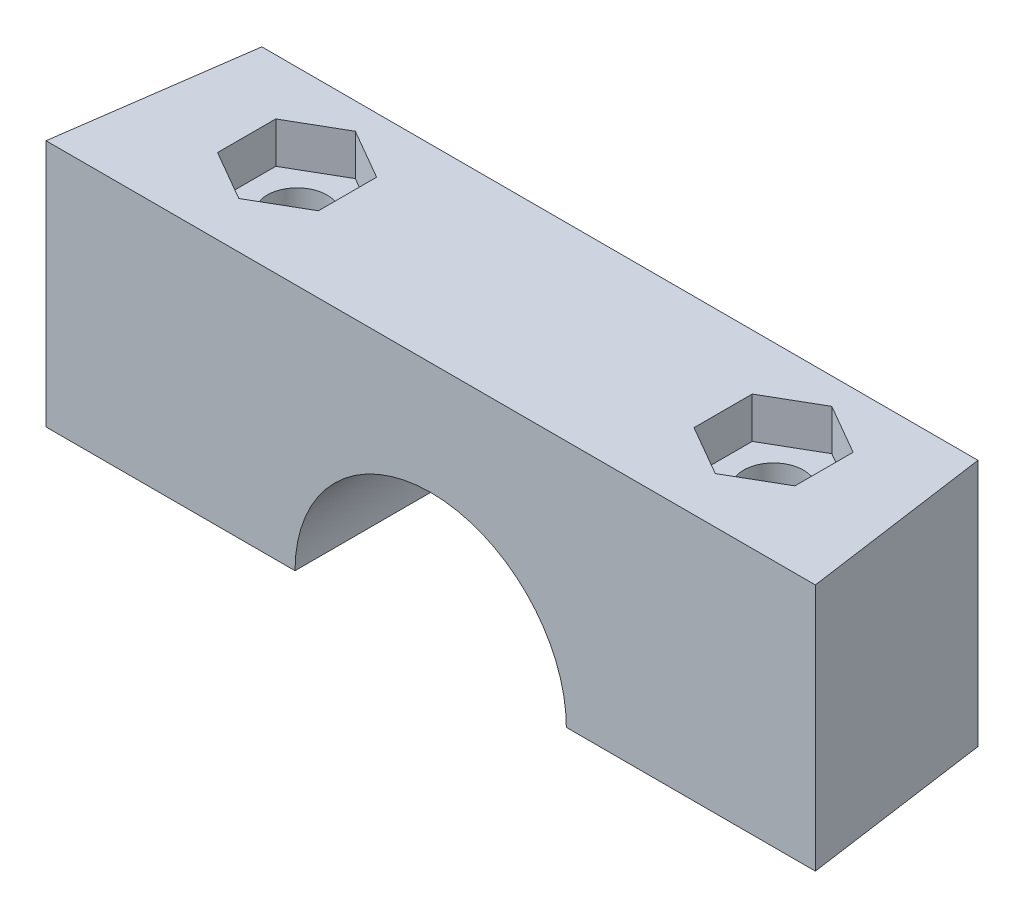
ISO-10303-21;
HEADER;
FILE_DESCRIPTION(('STEP AP214'),'2;1');
FILE_NAME('part.step','',(''),(''),'','','');
FILE_SCHEMA(('AUTOMOTIVE_DESIGN { 1 0 10303 214 1 1 1 1 }'));
ENDSEC;
DATA;
#1=APPLICATION_CONTEXT('core data for automotive mechanical design processes');
#2=APPLICATION_PROTOCOL_DEFINITION('international standard','automotive_design',2000,#1);
#3=PRODUCT_CONTEXT('',#1,'mechanical');
#4=PRODUCT('Part','Part','',(#3));
#5=PRODUCT_RELATED_PRODUCT_CATEGORY('part','',(#4));
#6=PRODUCT_DEFINITION_FORMATION('','',#4);
#7=PRODUCT_DEFINITION_CONTEXT('part definition',#1,'design');
#8=PRODUCT_DEFINITION('design','',#6,#7);
#9=PRODUCT_DEFINITION_SHAPE('','',#8);
#10=(LENGTH_UNIT() NAMED_UNIT(*) SI_UNIT(.MILLI.,.METRE.));
#11=(NAMED_UNIT(*) PLANE_ANGLE_UNIT() SI_UNIT($,.RADIAN.));
#12=(NAMED_UNIT(*) SI_UNIT($,.STERADIAN.) SOLID_ANGLE_UNIT());
#13=UNCERTAINTY_MEASURE_WITH_UNIT(LENGTH_MEASURE(1.E-05),#10,'distance_accuracy_value','');
#14=(GEOMETRIC_REPRESENTATION_CONTEXT(3) GLOBAL_UNCERTAINTY_ASSIGNED_CONTEXT((#13)) GLOBAL_UNIT_ASSIGNED_CONTEXT((#10,
#11,#12)) REPRESENTATION_CONTEXT('',''));
#15=CARTESIAN_POINT('',(0.,0.,0.));
#16=DIRECTION('',(0.,0.,1.));
#17=DIRECTION('',(1.,0.,0.));
#18=AXIS2_PLACEMENT_3D('',#15,#16,#17);
#19=CARTESIAN_POINT('',(12.0979916573324,14.5,41.4619194061058));
#20=DIRECTION('',(0.,1.,0.));
#21=DIRECTION('',(0.,0.,1.));
#22=AXIS2_PLACEMENT_3D('',#19,#20,#21);
#23=CYLINDRICAL_SURFACE('',#22,1.750000056);
#24=CARTESIAN_POINT('',(12.0979916573324,12.1,41.4619194061058));
#25=DIRECTION('',(0.,1.,0.));
#26=DIRECTION('',(0.,0.,1.));
#27=AXIS2_PLACEMENT_3D('',#24,#25,#26);
#28=CIRCLE('',#27,1.750000056);
#29=CARTESIAN_POINT('',(12.0979916573324,12.1,43.2119194621058));
#30=VERTEX_POINT('',#29);
#31=EDGE_CURVE('E351',#30,#30,#28,.T.);
#32=ORIENTED_EDGE('',*,*,#31,.T.);
#33=EDGE_LOOP('',(#32));
#34=FACE_BOUND('',#33,.T.);
#35=CARTESIAN_POINT('',(12.0979916573324,2.4,41.4619194061058));
#36=DIRECTION('',(0.,-1.,0.));
#37=DIRECTION('',(0.,0.,-1.));
#38=AXIS2_PLACEMENT_3D('',#35,#36,#37);
#39=CIRCLE('',#38,1.750000056);
#40=CARTESIAN_POINT('',(12.0979916573324,2.4,39.7119193501059));
#41=VERTEX_POINT('',#40);
#42=EDGE_CURVE('E40',#41,#41,#39,.F.);
#43=ORIENTED_EDGE('',*,*,#42,.F.);
#44=EDGE_LOOP('',(#43));
#45=FACE_BOUND('',#44,.T.);
#46=ADVANCED_FACE('F36',(#34,#45),#23,.F.);
#47=CARTESIAN_POINT('',(-15.7718197692763,14.5,41.4619194061059));
#48=DIRECTION('',(0.,1.,0.));
#49=DIRECTION('',(0.,0.,1.));
#50=AXIS2_PLACEMENT_3D('',#47,#48,#49);
#51=CYLINDRICAL_SURFACE('',#50,1.750000056);
#52=CARTESIAN_POINT('',(-15.7718197692763,12.1,41.4619194061059));
#53=DIRECTION('',(0.,1.,0.));
#54=DIRECTION('',(0.,0.,1.));
#55=AXIS2_PLACEMENT_3D('',#52,#53,#54);
#56=CIRCLE('',#55,1.750000056);
#57=CARTESIAN_POINT('',(-15.7718197692763,12.1,43.2119194621059));
#58=VERTEX_POINT('',#57);
#59=EDGE_CURVE('E348',#58,#58,#56,.T.);
#60=ORIENTED_EDGE('',*,*,#59,.T.);
#61=EDGE_LOOP('',(#60));
#62=FACE_BOUND('',#61,.T.);
#63=CARTESIAN_POINT('',(-15.7718197692763,2.4,41.4619194061059));
#64=DIRECTION('',(0.,-1.,0.));
#65=DIRECTION('',(0.,0.,-1.));
#66=AXIS2_PLACEMENT_3D('',#63,#64,#65);
#67=CIRCLE('',#66,1.750000056);
#68=CARTESIAN_POINT('',(-15.7718197692763,2.4,39.7119193501059));
#69=VERTEX_POINT('',#68);
#70=EDGE_CURVE('E284',#69,#69,#67,.F.);
#71=ORIENTED_EDGE('',*,*,#70,.F.);
#72=EDGE_LOOP('',(#71));
#73=FACE_BOUND('',#72,.T.);
#74=ADVANCED_FACE('F486',(#62,#73),#51,.F.);
#75=CARTESIAN_POINT('',(0.,0.,0.));
#76=DIRECTION('',(0.,-1.,0.));
#77=DIRECTION('',(0.,0.,-1.));
#78=AXIS2_PLACEMENT_3D('',#75,#76,#77);
#79=PLANE('',#78);
#80=DIRECTION('',(0.866025403784439,0.,-0.499999999999999));
#81=VECTOR('',#80,1.);
#82=CARTESIAN_POINT('',(9.14799165733238,0.,39.7587361119964));
#83=LINE('',#82,#81);
#84=CARTESIAN_POINT('',(9.14799165733238,0.,39.7587361119964));
#85=VERTEX_POINT('',#84);
#86=CARTESIAN_POINT('',(12.0979916573324,0.,38.0555528178871));
#87=VERTEX_POINT('',#86);
#88=EDGE_CURVE('E53',#85,#87,#83,.T.);
#89=ORIENTED_EDGE('',*,*,#88,.F.);
#90=DIRECTION('',(0.,0.,-1.));
#91=VECTOR('',#90,1.);
#92=CARTESIAN_POINT('',(9.14799165733238,0.,43.1651027002152));
#93=LINE('',#92,#91);
#94=CARTESIAN_POINT('',(9.14799165733238,0.,43.1651027002152));
#95=VERTEX_POINT('',#94);
#96=EDGE_CURVE('E296',#95,#85,#93,.T.);
#97=ORIENTED_EDGE('',*,*,#96,.F.);
#98=DIRECTION('',(-0.866025403784438,0.,-0.500000000000001));
#99=VECTOR('',#98,1.);
#100=CARTESIAN_POINT('',(12.0979916573324,0.,44.8682859943246));
#101=LINE('',#100,#99);
#102=CARTESIAN_POINT('',(12.0979916573324,0.,44.8682859943246));
#103=VERTEX_POINT('',#102);
#104=EDGE_CURVE('E322',#103,#95,#101,.T.);
#105=ORIENTED_EDGE('',*,*,#104,.F.);
#106=DIRECTION('',(-0.866025403784439,0.,0.5));
#107=VECTOR('',#106,1.);
#108=CARTESIAN_POINT('',(15.0479916573324,0.,43.1651027002152));
#109=LINE('',#108,#107);
#110=CARTESIAN_POINT('',(15.0479916573324,0.,43.1651027002152));
#111=VERTEX_POINT('',#110);
#112=EDGE_CURVE('E319',#111,#103,#109,.T.);
#113=ORIENTED_EDGE('',*,*,#112,.F.);
#114=DIRECTION('',(0.,0.,1.));
#115=VECTOR('',#114,1.);
#116=CARTESIAN_POINT('',(15.0479916573324,0.,39.7587361119965));
#117=LINE('',#116,#115);
#118=CARTESIAN_POINT('',(15.0479916573324,0.,39.7587361119965));
#119=VERTEX_POINT('',#118);
#120=EDGE_CURVE('E316',#119,#111,#117,.T.);
#121=ORIENTED_EDGE('',*,*,#120,.F.);
#122=DIRECTION('',(0.866025403784439,0.,0.499999999999999));
#123=VECTOR('',#122,1.);
#124=CARTESIAN_POINT('',(12.0979916573324,0.,38.0555528178871));
#125=LINE('',#124,#123);
#126=EDGE_CURVE('E313',#87,#119,#125,.T.);
#127=ORIENTED_EDGE('',*,*,#126,.F.);
#128=EDGE_LOOP('',(#89,#97,#105,#113,#121,#127));
#129=FACE_BOUND('',#128,.T.);
#130=DIRECTION('',(-1.,0.,0.));
#131=VECTOR('',#130,1.);
#132=CARTESIAN_POINT('',(0.,0.,36.5131625896884));
#133=LINE('',#132,#131);
#134=CARTESIAN_POINT('',(19.107473621931,0.,36.5131625896884));
#135=VERTEX_POINT('',#134);
#136=CARTESIAN_POINT('',(6.09808594402809,0.,36.5131625896884));
#137=VERTEX_POINT('',#136);
#138=EDGE_CURVE('E346',#135,#137,#133,.T.);
#139=ORIENTED_EDGE('',*,*,#138,.F.);
#140=DIRECTION('',(0.139173100960062,0.,0.990268068741571));
#141=VECTOR('',#140,1.);
#142=CARTESIAN_POINT('',(13.163085944028,0.,-5.78335351177704));
#143=LINE('',#142,#141);
#144=CARTESIAN_POINT('',(20.6630859440281,0.,47.5819194061059));
#145=VERTEX_POINT('',#144);
#146=EDGE_CURVE('E455',#135,#145,#143,.T.);
#147=ORIENTED_EDGE('',*,*,#146,.T.);
#148=DIRECTION('',(-1.,0.,0.));
#149=VECTOR('',#148,1.);
#150=CARTESIAN_POINT('',(20.6630859440281,0.,47.5819194061059));
#151=LINE('',#150,#149);
#152=CARTESIAN_POINT('',(6.09808594402809,0.,47.5819194061059));
#153=VERTEX_POINT('',#152);
#154=EDGE_CURVE('E461',#145,#153,#151,.T.);
#155=ORIENTED_EDGE('',*,*,#154,.T.);
#156=DIRECTION('',(0.,0.,1.));
#157=VECTOR('',#156,1.);
#158=CARTESIAN_POINT('',(6.09808594402809,0.,-40.4180805938941));
#159=LINE('',#158,#157);
#160=EDGE_CURVE('E45',#137,#153,#159,.T.);
#161=ORIENTED_EDGE('',*,*,#160,.F.);
#162=EDGE_LOOP('',(#139,#147,#155,#161));
#163=FACE_BOUND('',#162,.T.);
#164=ADVANCED_FACE('F492',(#129,#163),#79,.T.);
#165=CARTESIAN_POINT('',(20.6630859440281,14.5,47.5819194061059));
#166=DIRECTION('',(0.,0.,1.));
#167=DIRECTION('',(1.,0.,0.));
#168=AXIS2_PLACEMENT_3D('',#165,#166,#167);
#169=PLANE('',#168);
#170=CARTESIAN_POINT('',(-1.83691405597191,0.,47.5819194061059));
#171=DIRECTION('',(0.,0.,1.));
#172=DIRECTION('',(1.,0.,0.));
#173=AXIS2_PLACEMENT_3D('',#170,#171,#172);
#174=CIRCLE('',#173,7.935);
#175=CARTESIAN_POINT('',(-9.7719140559719,0.,47.5819194061059));
#176=VERTEX_POINT('',#175);
#177=EDGE_CURVE('E391',#153,#176,#174,.T.);
#178=ORIENTED_EDGE('',*,*,#177,.F.);
#179=ORIENTED_EDGE('',*,*,#154,.F.);
#180=DIRECTION('',(0.,-1.,0.));
#181=VECTOR('',#180,1.);
#182=CARTESIAN_POINT('',(20.6630859440281,14.5,47.5819194061059));
#183=LINE('',#182,#181);
#184=CARTESIAN_POINT('',(20.6630859440281,14.5,47.5819194061059));
#185=VERTEX_POINT('',#184);
#186=EDGE_CURVE('E468',#185,#145,#183,.T.);
#187=ORIENTED_EDGE('',*,*,#186,.F.);
#188=DIRECTION('',(-1.,0.,0.));
#189=VECTOR('',#188,1.);
#190=CARTESIAN_POINT('',(20.6630859440281,14.5,47.5819194061059));
#191=LINE('',#190,#189);
#192=CARTESIAN_POINT('',(-24.3369140559719,14.5,47.5819194061059));
#193=VERTEX_POINT('',#192);
#194=EDGE_CURVE('E451',#185,#193,#191,.T.);
#195=ORIENTED_EDGE('',*,*,#194,.T.);
#196=DIRECTION('',(0.,-1.,0.));
#197=VECTOR('',#196,1.);
#198=CARTESIAN_POINT('',(-24.3369140559719,14.5,47.5819194061059));
#199=LINE('',#198,#197);
#200=CARTESIAN_POINT('',(-24.3369140559719,0.,47.5819194061059));
#201=VERTEX_POINT('',#200);
#202=EDGE_CURVE('E460',#193,#201,#199,.T.);
#203=ORIENTED_EDGE('',*,*,#202,.T.);
#204=EDGE_CURVE('E450',#176,#201,#151,.T.);
#205=ORIENTED_EDGE('',*,*,#204,.F.);
#206=EDGE_LOOP('',(#178,#179,#187,#195,#203,#205));
#207=FACE_BOUND('',#206,.T.);
#208=ADVANCED_FACE('F38',(#207),#169,.T.);
#209=CARTESIAN_POINT('',(13.163085944028,14.5,-5.78335351177704));
#210=DIRECTION('',(0.990268068741571,0.,-0.139173100960062));
#211=DIRECTION('',(-0.139173100960062,0.,-0.990268068741571));
#212=AXIS2_PLACEMENT_3D('',#209,#210,#211);
#213=PLANE('',#212);
#214=DIRECTION('',(0.,1.,0.));
#215=VECTOR('',#214,1.);
#216=CARTESIAN_POINT('',(19.107473621931,-7.9,36.5131625896884));
#217=LINE('',#216,#215);
#218=CARTESIAN_POINT('',(19.107473621931,14.5,36.5131625896884));
#219=VERTEX_POINT('',#218);
#220=EDGE_CURVE('E340',#135,#219,#217,.T.);
#221=ORIENTED_EDGE('',*,*,#220,.T.);
#222=DIRECTION('',(0.139173100960062,0.,0.990268068741571));
#223=VECTOR('',#222,1.);
#224=CARTESIAN_POINT('',(13.163085944028,14.5,-5.78335351177704));
#225=LINE('',#224,#223);
#226=EDGE_CURVE('E458',#219,#185,#225,.T.);
#227=ORIENTED_EDGE('',*,*,#226,.T.);
#228=ORIENTED_EDGE('',*,*,#186,.T.);
#229=ORIENTED_EDGE('',*,*,#146,.F.);
#230=EDGE_LOOP('',(#221,#227,#228,#229));
#231=FACE_BOUND('',#230,.T.);
#232=ADVANCED_FACE('F567',(#231),#213,.T.);
#233=CARTESIAN_POINT('',(-24.3369140559719,14.5,47.5819194061059));
#234=DIRECTION('',(-0.990268068741571,0.,-0.139173100960062));
#235=DIRECTION('',(-0.139173100960062,0.,0.990268068741571));
#236=AXIS2_PLACEMENT_3D('',#233,#234,#235);
#237=PLANE('',#236);
#238=DIRECTION('',(0.,1.,0.));
#239=VECTOR('',#238,1.);
#240=CARTESIAN_POINT('',(-22.7813017338749,-7.9,36.5131625896884));
#241=LINE('',#240,#239);
#242=CARTESIAN_POINT('',(-22.7813017338749,0.,36.5131625896884));
#243=VERTEX_POINT('',#242);
#244=CARTESIAN_POINT('',(-22.7813017338749,14.5,36.5131625896884));
#245=VERTEX_POINT('',#244);
#246=EDGE_CURVE('E339',#243,#245,#241,.T.);
#247=ORIENTED_EDGE('',*,*,#246,.F.);
#248=DIRECTION('',(0.139173100960062,0.,-0.990268068741571));
#249=VECTOR('',#248,1.);
#250=CARTESIAN_POINT('',(-24.3369140559719,0.,47.5819194061059));
#251=LINE('',#250,#249);
#252=EDGE_CURVE('E464',#201,#243,#251,.T.);
#253=ORIENTED_EDGE('',*,*,#252,.F.);
#254=ORIENTED_EDGE('',*,*,#202,.F.);
#255=DIRECTION('',(0.139173100960062,0.,-0.990268068741571));
#256=VECTOR('',#255,1.);
#257=CARTESIAN_POINT('',(-24.3369140559719,14.5,47.5819194061059));
#258=LINE('',#257,#256);
#259=EDGE_CURVE('E454',#193,#245,#258,.T.);
#260=ORIENTED_EDGE('',*,*,#259,.T.);
#261=EDGE_LOOP('',(#247,#253,#254,#260));
#262=FACE_BOUND('',#261,.T.);
#263=ADVANCED_FACE('F562',(#262),#237,.T.);
#264=CARTESIAN_POINT('',(0.,14.5,0.));
#265=DIRECTION('',(0.,-1.,0.));
#266=DIRECTION('',(0.,0.,-1.));
#267=AXIS2_PLACEMENT_3D('',#264,#265,#266);
#268=PLANE('',#267);
#269=DIRECTION('',(0.866025403784439,0.,-0.5));
#270=VECTOR('',#269,1.);
#271=CARTESIAN_POINT('',(12.0979916573324,14.5,44.8682859943246));
#272=LINE('',#271,#270);
#273=CARTESIAN_POINT('',(12.0979916573324,14.5,44.8682859943246));
#274=VERTEX_POINT('',#273);
#275=CARTESIAN_POINT('',(15.0479916573324,14.5,43.1651027002153));
#276=VERTEX_POINT('',#275);
#277=EDGE_CURVE('E424',#274,#276,#272,.T.);
#278=ORIENTED_EDGE('',*,*,#277,.F.);
#279=DIRECTION('',(0.866025403784439,0.,0.5));
#280=VECTOR('',#279,1.);
#281=CARTESIAN_POINT('',(9.14799165733239,14.5,43.1651027002152));
#282=LINE('',#281,#280);
#283=CARTESIAN_POINT('',(9.14799165733239,14.5,43.1651027002152));
#284=VERTEX_POINT('',#283);
#285=EDGE_CURVE('E422',#284,#274,#282,.T.);
#286=ORIENTED_EDGE('',*,*,#285,.F.);
#287=DIRECTION('',(0.,0.,1.));
#288=VECTOR('',#287,1.);
#289=CARTESIAN_POINT('',(9.14799165733239,14.5,39.7587361119964));
#290=LINE('',#289,#288);
#291=CARTESIAN_POINT('',(9.14799165733239,14.5,39.7587361119964));
#292=VERTEX_POINT('',#291);
#293=EDGE_CURVE('E406',#292,#284,#290,.T.);
#294=ORIENTED_EDGE('',*,*,#293,.F.);
#295=DIRECTION('',(-0.866025403784439,0.,0.5));
#296=VECTOR('',#295,1.);
#297=CARTESIAN_POINT('',(12.0979916573324,14.5,38.0555528178871));
#298=LINE('',#297,#296);
#299=CARTESIAN_POINT('',(12.0979916573324,14.5,38.0555528178871));
#300=VERTEX_POINT('',#299);
#301=EDGE_CURVE('E433',#300,#292,#298,.T.);
#302=ORIENTED_EDGE('',*,*,#301,.F.);
#303=DIRECTION('',(-0.866025403784439,0.,-0.5));
#304=VECTOR('',#303,1.);
#305=CARTESIAN_POINT('',(15.0479916573324,14.5,39.7587361119964));
#306=LINE('',#305,#304);
#307=CARTESIAN_POINT('',(15.0479916573324,14.5,39.7587361119964));
#308=VERTEX_POINT('',#307);
#309=EDGE_CURVE('E430',#308,#300,#306,.T.);
#310=ORIENTED_EDGE('',*,*,#309,.F.);
#311=DIRECTION('',(0.,0.,-1.));
#312=VECTOR('',#311,1.);
#313=CARTESIAN_POINT('',(15.0479916573324,14.5,43.1651027002153));
#314=LINE('',#313,#312);
#315=EDGE_CURVE('E427',#276,#308,#314,.T.);
#316=ORIENTED_EDGE('',*,*,#315,.F.);
#317=EDGE_LOOP('',(#278,#286,#294,#302,#310,#316));
#318=FACE_BOUND('',#317,.T.);
#319=DIRECTION('',(0.866025403784439,0.,-0.5));
#320=VECTOR('',#319,1.);
#321=CARTESIAN_POINT('',(-15.7718197692763,14.5,44.8682859943246));
#322=LINE('',#321,#320);
#323=CARTESIAN_POINT('',(-15.7718197692763,14.5,44.8682859943246));
#324=VERTEX_POINT('',#323);
#325=CARTESIAN_POINT('',(-12.8218197692763,14.5,43.1651027002152));
#326=VERTEX_POINT('',#325);
#327=EDGE_CURVE('E374',#324,#326,#322,.T.);
#328=ORIENTED_EDGE('',*,*,#327,.F.);
#329=DIRECTION('',(0.866025403784439,0.,0.5));
#330=VECTOR('',#329,1.);
#331=CARTESIAN_POINT('',(-18.7218197692763,14.5,43.1651027002153));
#332=LINE('',#331,#330);
#333=CARTESIAN_POINT('',(-18.7218197692763,14.5,43.1651027002153));
#334=VERTEX_POINT('',#333);
#335=EDGE_CURVE('E372',#334,#324,#332,.T.);
#336=ORIENTED_EDGE('',*,*,#335,.F.);
#337=DIRECTION('',(0.,0.,1.));
#338=VECTOR('',#337,1.);
#339=CARTESIAN_POINT('',(-18.7218197692763,14.5,39.7587361119965));
#340=LINE('',#339,#338);
#341=CARTESIAN_POINT('',(-18.7218197692763,14.5,39.7587361119965));
#342=VERTEX_POINT('',#341);
#343=EDGE_CURVE('E356',#342,#334,#340,.T.);
#344=ORIENTED_EDGE('',*,*,#343,.F.);
#345=DIRECTION('',(-0.866025403784439,0.,0.5));
#346=VECTOR('',#345,1.);
#347=CARTESIAN_POINT('',(-15.7718197692763,14.5,38.0555528178871));
#348=LINE('',#347,#346);
#349=CARTESIAN_POINT('',(-15.7718197692763,14.5,38.0555528178871));
#350=VERTEX_POINT('',#349);
#351=EDGE_CURVE('E384',#350,#342,#348,.T.);
#352=ORIENTED_EDGE('',*,*,#351,.F.);
#353=DIRECTION('',(-0.866025403784439,0.,-0.5));
#354=VECTOR('',#353,1.);
#355=CARTESIAN_POINT('',(-12.8218197692763,14.5,39.7587361119965));
#356=LINE('',#355,#354);
#357=CARTESIAN_POINT('',(-12.8218197692763,14.5,39.7587361119965));
#358=VERTEX_POINT('',#357);
#359=EDGE_CURVE('E381',#358,#350,#356,.T.);
#360=ORIENTED_EDGE('',*,*,#359,.F.);
#361=DIRECTION('',(0.,0.,-1.));
#362=VECTOR('',#361,1.);
#363=CARTESIAN_POINT('',(-12.8218197692763,14.5,43.1651027002152));
#364=LINE('',#363,#362);
#365=EDGE_CURVE('E378',#326,#358,#364,.T.);
#366=ORIENTED_EDGE('',*,*,#365,.F.);
#367=EDGE_LOOP('',(#328,#336,#344,#352,#360,#366));
#368=FACE_BOUND('',#367,.T.);
#369=ORIENTED_EDGE('',*,*,#226,.F.);
#370=DIRECTION('',(1.,0.,0.));
#371=VECTOR('',#370,1.);
#372=CARTESIAN_POINT('',(-22.7813017338749,14.5,36.5131625896884));
#373=LINE('',#372,#371);
#374=EDGE_CURVE('E337',#245,#219,#373,.T.);
#375=ORIENTED_EDGE('',*,*,#374,.F.);
#376=ORIENTED_EDGE('',*,*,#259,.F.);
#377=ORIENTED_EDGE('',*,*,#194,.F.);
#378=EDGE_LOOP('',(#369,#375,#376,#377));
#379=FACE_BOUND('',#378,.T.);
#380=ADVANCED_FACE('F559',(#318,#368,#379),#268,.F.);
#381=DIRECTION('',(0.866025403784439,0.,-0.5));
#382=VECTOR('',#381,1.);
#383=CARTESIAN_POINT('',(-18.7218197692763,0.,39.7587361119965));
#384=LINE('',#383,#382);
#385=CARTESIAN_POINT('',(-18.7218197692763,0.,39.7587361119965));
#386=VERTEX_POINT('',#385);
#387=CARTESIAN_POINT('',(-15.7718197692763,0.,38.0555528178871));
#388=VERTEX_POINT('',#387);
#389=EDGE_CURVE('E61',#386,#388,#384,.T.);
#390=ORIENTED_EDGE('',*,*,#389,.F.);
#391=DIRECTION('',(0.,0.,-1.));
#392=VECTOR('',#391,1.);
#393=CARTESIAN_POINT('',(-18.7218197692763,0.,43.1651027002153));
#394=LINE('',#393,#392);
#395=CARTESIAN_POINT('',(-18.7218197692763,0.,43.1651027002153));
#396=VERTEX_POINT('',#395);
#397=EDGE_CURVE('E257',#396,#386,#394,.T.);
#398=ORIENTED_EDGE('',*,*,#397,.F.);
#399=DIRECTION('',(-0.866025403784438,0.,-0.500000000000001));
#400=VECTOR('',#399,1.);
#401=CARTESIAN_POINT('',(-15.7718197692763,0.,44.8682859943247));
#402=LINE('',#401,#400);
#403=CARTESIAN_POINT('',(-15.7718197692763,0.,44.8682859943247));
#404=VERTEX_POINT('',#403);
#405=EDGE_CURVE('E260',#404,#396,#402,.T.);
#406=ORIENTED_EDGE('',*,*,#405,.F.);
#407=DIRECTION('',(-0.866025403784439,0.,0.5));
#408=VECTOR('',#407,1.);
#409=CARTESIAN_POINT('',(-12.8218197692763,0.,43.1651027002153));
#410=LINE('',#409,#408);
#411=CARTESIAN_POINT('',(-12.8218197692763,0.,43.1651027002153));
#412=VERTEX_POINT('',#411);
#413=EDGE_CURVE('E277',#412,#404,#410,.T.);
#414=ORIENTED_EDGE('',*,*,#413,.F.);
#415=DIRECTION('',(0.,0.,1.));
#416=VECTOR('',#415,1.);
#417=CARTESIAN_POINT('',(-12.8218197692763,0.,39.7587361119965));
#418=LINE('',#417,#416);
#419=CARTESIAN_POINT('',(-12.8218197692763,0.,39.7587361119965));
#420=VERTEX_POINT('',#419);
#421=EDGE_CURVE('E274',#420,#412,#418,.T.);
#422=ORIENTED_EDGE('',*,*,#421,.F.);
#423=DIRECTION('',(0.866025403784439,0.,0.499999999999999));
#424=VECTOR('',#423,1.);
#425=CARTESIAN_POINT('',(-15.7718197692763,0.,38.0555528178871));
#426=LINE('',#425,#424);
#427=EDGE_CURVE('E271',#388,#420,#426,.T.);
#428=ORIENTED_EDGE('',*,*,#427,.F.);
#429=EDGE_LOOP('',(#390,#398,#406,#414,#422,#428));
#430=FACE_BOUND('',#429,.T.);
#431=DIRECTION('',(-1.,0.,0.));
#432=VECTOR('',#431,1.);
#433=CARTESIAN_POINT('',(0.,0.,36.5131625896884));
#434=LINE('',#433,#432);
#435=CARTESIAN_POINT('',(-9.77191405597191,0.,36.5131625896884));
#436=VERTEX_POINT('',#435);
#437=EDGE_CURVE('E343',#436,#243,#434,.T.);
#438=ORIENTED_EDGE('',*,*,#437,.F.);
#439=DIRECTION('',(0.,0.,1.));
#440=VECTOR('',#439,1.);
#441=CARTESIAN_POINT('',(-9.77191405597191,0.,-40.4180805938941));
#442=LINE('',#441,#440);
#443=EDGE_CURVE('E471',#176,#436,#442,.F.);
#444=ORIENTED_EDGE('',*,*,#443,.F.);
#445=ORIENTED_EDGE('',*,*,#204,.T.);
#446=ORIENTED_EDGE('',*,*,#252,.T.);
#447=EDGE_LOOP('',(#438,#444,#445,#446));
#448=FACE_BOUND('',#447,.T.);
#449=ADVANCED_FACE('F557',(#430,#448),#79,.T.);
#450=CARTESIAN_POINT('',(-1.83691405597191,0.,-40.4180805938941));
#451=DIRECTION('',(0.,0.,1.));
#452=DIRECTION('',(1.,0.,0.));
#453=AXIS2_PLACEMENT_3D('',#450,#451,#452);
#454=CYLINDRICAL_SURFACE('',#453,7.935);
#455=ORIENTED_EDGE('',*,*,#443,.T.);
#456=CARTESIAN_POINT('',(-1.83691405597191,0.,36.5131625896884));
#457=DIRECTION('',(0.,0.,1.));
#458=DIRECTION('',(1.,0.,0.));
#459=AXIS2_PLACEMENT_3D('',#456,#457,#458);
#460=CIRCLE('',#459,7.935);
#461=EDGE_CURVE('E11',#436,#137,#460,.F.);
#462=ORIENTED_EDGE('',*,*,#461,.T.);
#463=ORIENTED_EDGE('',*,*,#160,.T.);
#464=ORIENTED_EDGE('',*,*,#177,.T.);
#465=EDGE_LOOP('',(#455,#462,#463,#464));
#466=FACE_BOUND('',#465,.T.);
#467=ADVANCED_FACE('F525',(#466),#454,.F.);
#468=CARTESIAN_POINT('',(-18.7218197692763,12.1,43.1651027002153));
#469=DIRECTION('',(-0.5,0.,0.866025403784439));
#470=DIRECTION('',(0.866025403784439,0.,0.5));
#471=AXIS2_PLACEMENT_3D('',#468,#469,#470);
#472=PLANE('',#471);
#473=ORIENTED_EDGE('',*,*,#335,.T.);
#474=DIRECTION('',(0.,1.,0.));
#475=VECTOR('',#474,1.);
#476=CARTESIAN_POINT('',(-15.7718197692763,12.1,44.8682859943246));
#477=LINE('',#476,#475);
#478=CARTESIAN_POINT('',(-15.7718197692763,12.1,44.8682859943246));
#479=VERTEX_POINT('',#478);
#480=EDGE_CURVE('E371',#479,#324,#477,.T.);
#481=ORIENTED_EDGE('',*,*,#480,.F.);
#482=DIRECTION('',(0.866025403784439,0.,0.5));
#483=VECTOR('',#482,1.);
#484=CARTESIAN_POINT('',(-18.7218197692763,12.1,43.1651027002153));
#485=LINE('',#484,#483);
#486=CARTESIAN_POINT('',(-18.7218197692763,12.1,43.1651027002153));
#487=VERTEX_POINT('',#486);
#488=EDGE_CURVE('E352',#487,#479,#485,.T.);
#489=ORIENTED_EDGE('',*,*,#488,.F.);
#490=DIRECTION('',(0.,1.,0.));
#491=VECTOR('',#490,1.);
#492=CARTESIAN_POINT('',(-18.7218197692763,12.1,43.1651027002153));
#493=LINE('',#492,#491);
#494=EDGE_CURVE('E389',#487,#334,#493,.T.);
#495=ORIENTED_EDGE('',*,*,#494,.T.);
#496=EDGE_LOOP('',(#473,#481,#489,#495));
#497=FACE_BOUND('',#496,.T.);
#498=ADVANCED_FACE('F507',(#497),#472,.F.);
#499=CARTESIAN_POINT('',(-18.7218197692763,12.1,39.7587361119965));
#500=DIRECTION('',(-1.,0.,0.));
#501=DIRECTION('',(0.,0.,1.));
#502=AXIS2_PLACEMENT_3D('',#499,#500,#501);
#503=PLANE('',#502);
#504=ORIENTED_EDGE('',*,*,#343,.T.);
#505=ORIENTED_EDGE('',*,*,#494,.F.);
#506=DIRECTION('',(0.,0.,1.));
#507=VECTOR('',#506,1.);
#508=CARTESIAN_POINT('',(-18.7218197692763,12.1,39.7587361119965));
#509=LINE('',#508,#507);
#510=CARTESIAN_POINT('',(-18.7218197692763,12.1,39.7587361119965));
#511=VERTEX_POINT('',#510);
#512=EDGE_CURVE('E368',#511,#487,#509,.T.);
#513=ORIENTED_EDGE('',*,*,#512,.F.);
#514=DIRECTION('',(0.,1.,0.));
#515=VECTOR('',#514,1.);
#516=CARTESIAN_POINT('',(-18.7218197692763,12.1,39.7587361119965));
#517=LINE('',#516,#515);
#518=EDGE_CURVE('E392',#511,#342,#517,.T.);
#519=ORIENTED_EDGE('',*,*,#518,.T.);
#520=EDGE_LOOP('',(#504,#505,#513,#519));
#521=FACE_BOUND('',#520,.T.);
#522=ADVANCED_FACE('F503',(#521),#503,.F.);
#523=CARTESIAN_POINT('',(-15.7718197692763,12.1,38.0555528178871));
#524=DIRECTION('',(-0.5,0.,-0.866025403784439));
#525=DIRECTION('',(-0.866025403784439,0.,0.5));
#526=AXIS2_PLACEMENT_3D('',#523,#524,#525);
#527=PLANE('',#526);
#528=ORIENTED_EDGE('',*,*,#351,.T.);
#529=ORIENTED_EDGE('',*,*,#518,.F.);
#530=DIRECTION('',(-0.866025403784439,0.,0.5));
#531=VECTOR('',#530,1.);
#532=CARTESIAN_POINT('',(-15.7718197692763,12.1,38.0555528178871));
#533=LINE('',#532,#531);
#534=CARTESIAN_POINT('',(-15.7718197692763,12.1,38.0555528178871));
#535=VERTEX_POINT('',#534);
#536=EDGE_CURVE('E365',#535,#511,#533,.T.);
#537=ORIENTED_EDGE('',*,*,#536,.F.);
#538=DIRECTION('',(0.,1.,0.));
#539=VECTOR('',#538,1.);
#540=CARTESIAN_POINT('',(-15.7718197692763,12.1,38.0555528178871));
#541=LINE('',#540,#539);
#542=EDGE_CURVE('E394',#535,#350,#541,.T.);
#543=ORIENTED_EDGE('',*,*,#542,.T.);
#544=EDGE_LOOP('',(#528,#529,#537,#543));
#545=FACE_BOUND('',#544,.T.);
#546=ADVANCED_FACE('F506',(#545),#527,.F.);
#547=CARTESIAN_POINT('',(-12.8218197692763,12.1,39.7587361119965));
#548=DIRECTION('',(0.5,0.,-0.866025403784439));
#549=DIRECTION('',(-0.866025403784439,0.,-0.5));
#550=AXIS2_PLACEMENT_3D('',#547,#548,#549);
#551=PLANE('',#550);
#552=ORIENTED_EDGE('',*,*,#359,.T.);
#553=ORIENTED_EDGE('',*,*,#542,.F.);
#554=DIRECTION('',(-0.866025403784439,0.,-0.5));
#555=VECTOR('',#554,1.);
#556=CARTESIAN_POINT('',(-12.8218197692763,12.1,39.7587361119965));
#557=LINE('',#556,#555);
#558=CARTESIAN_POINT('',(-12.8218197692763,12.1,39.7587361119965));
#559=VERTEX_POINT('',#558);
#560=EDGE_CURVE('E362',#559,#535,#557,.T.);
#561=ORIENTED_EDGE('',*,*,#560,.F.);
#562=DIRECTION('',(0.,1.,0.));
#563=VECTOR('',#562,1.);
#564=CARTESIAN_POINT('',(-12.8218197692763,12.1,39.7587361119965));
#565=LINE('',#564,#563);
#566=EDGE_CURVE('E396',#559,#358,#565,.T.);
#567=ORIENTED_EDGE('',*,*,#566,.T.);
#568=EDGE_LOOP('',(#552,#553,#561,#567));
#569=FACE_BOUND('',#568,.T.);
#570=ADVANCED_FACE('F511',(#569),#551,.F.);
#571=CARTESIAN_POINT('',(-12.8218197692763,12.1,43.1651027002152));
#572=DIRECTION('',(1.,0.,0.));
#573=DIRECTION('',(0.,0.,-1.));
#574=AXIS2_PLACEMENT_3D('',#571,#572,#573);
#575=PLANE('',#574);
#576=ORIENTED_EDGE('',*,*,#365,.T.);
#577=ORIENTED_EDGE('',*,*,#566,.F.);
#578=DIRECTION('',(0.,0.,-1.));
#579=VECTOR('',#578,1.);
#580=CARTESIAN_POINT('',(-12.8218197692763,12.1,43.1651027002152));
#581=LINE('',#580,#579);
#582=CARTESIAN_POINT('',(-12.8218197692763,12.1,43.1651027002152));
#583=VERTEX_POINT('',#582);
#584=EDGE_CURVE('E359',#583,#559,#581,.T.);
#585=ORIENTED_EDGE('',*,*,#584,.F.);
#586=DIRECTION('',(0.,1.,0.));
#587=VECTOR('',#586,1.);
#588=CARTESIAN_POINT('',(-12.8218197692763,12.1,43.1651027002152));
#589=LINE('',#588,#587);
#590=EDGE_CURVE('E398',#583,#326,#589,.T.);
#591=ORIENTED_EDGE('',*,*,#590,.T.);
#592=EDGE_LOOP('',(#576,#577,#585,#591));
#593=FACE_BOUND('',#592,.T.);
#594=ADVANCED_FACE('F515',(#593),#575,.F.);
#595=CARTESIAN_POINT('',(-15.7718197692763,12.1,44.8682859943246));
#596=DIRECTION('',(0.5,0.,0.866025403784439));
#597=DIRECTION('',(0.866025403784439,0.,-0.5));
#598=AXIS2_PLACEMENT_3D('',#595,#596,#597);
#599=PLANE('',#598);
#600=ORIENTED_EDGE('',*,*,#327,.T.);
#601=ORIENTED_EDGE('',*,*,#590,.F.);
#602=DIRECTION('',(0.866025403784439,0.,-0.5));
#603=VECTOR('',#602,1.);
#604=CARTESIAN_POINT('',(-15.7718197692763,12.1,44.8682859943246));
#605=LINE('',#604,#603);
#606=EDGE_CURVE('E355',#479,#583,#605,.T.);
#607=ORIENTED_EDGE('',*,*,#606,.F.);
#608=ORIENTED_EDGE('',*,*,#480,.T.);
#609=EDGE_LOOP('',(#600,#601,#607,#608));
#610=FACE_BOUND('',#609,.T.);
#611=ADVANCED_FACE('F501',(#610),#599,.F.);
#612=CARTESIAN_POINT('',(0.,12.1,0.));
#613=DIRECTION('',(0.,1.,0.));
#614=DIRECTION('',(0.,0.,1.));
#615=AXIS2_PLACEMENT_3D('',#612,#613,#614);
#616=PLANE('',#615);
#617=ORIENTED_EDGE('',*,*,#59,.F.);
#618=EDGE_LOOP('',(#617));
#619=FACE_BOUND('',#618,.T.);
#620=ORIENTED_EDGE('',*,*,#488,.T.);
#621=ORIENTED_EDGE('',*,*,#606,.T.);
#622=ORIENTED_EDGE('',*,*,#584,.T.);
#623=ORIENTED_EDGE('',*,*,#560,.T.);
#624=ORIENTED_EDGE('',*,*,#536,.T.);
#625=ORIENTED_EDGE('',*,*,#512,.T.);
#626=EDGE_LOOP('',(#620,#621,#622,#623,#624,#625));
#627=FACE_BOUND('',#626,.T.);
#628=ADVANCED_FACE('F497',(#619,#627),#616,.T.);
#629=CARTESIAN_POINT('',(9.14799165733239,12.1,43.1651027002152));
#630=DIRECTION('',(-0.5,0.,0.866025403784439));
#631=DIRECTION('',(0.866025403784439,0.,0.5));
#632=AXIS2_PLACEMENT_3D('',#629,#630,#631);
#633=PLANE('',#632);
#634=ORIENTED_EDGE('',*,*,#285,.T.);
#635=DIRECTION('',(0.,1.,0.));
#636=VECTOR('',#635,1.);
#637=CARTESIAN_POINT('',(12.0979916573324,12.1,44.8682859943246));
#638=LINE('',#637,#636);
#639=CARTESIAN_POINT('',(12.0979916573324,12.1,44.8682859943246));
#640=VERTEX_POINT('',#639);
#641=EDGE_CURVE('E421',#640,#274,#638,.T.);
#642=ORIENTED_EDGE('',*,*,#641,.F.);
#643=DIRECTION('',(0.866025403784439,0.,0.5));
#644=VECTOR('',#643,1.);
#645=CARTESIAN_POINT('',(9.14799165733239,12.1,43.1651027002152));
#646=LINE('',#645,#644);
#647=CARTESIAN_POINT('',(9.14799165733239,12.1,43.1651027002152));
#648=VERTEX_POINT('',#647);
#649=EDGE_CURVE('E402',#648,#640,#646,.T.);
#650=ORIENTED_EDGE('',*,*,#649,.F.);
#651=DIRECTION('',(0.,1.,0.));
#652=VECTOR('',#651,1.);
#653=CARTESIAN_POINT('',(9.14799165733239,12.1,43.1651027002152));
#654=LINE('',#653,#652);
#655=EDGE_CURVE('E375',#648,#284,#654,.T.);
#656=ORIENTED_EDGE('',*,*,#655,.T.);
#657=EDGE_LOOP('',(#634,#642,#650,#656));
#658=FACE_BOUND('',#657,.T.);
#659=ADVANCED_FACE('F500',(#658),#633,.F.);
#660=CARTESIAN_POINT('',(9.14799165733239,12.1,39.7587361119964));
#661=DIRECTION('',(-1.,0.,0.));
#662=DIRECTION('',(0.,0.,1.));
#663=AXIS2_PLACEMENT_3D('',#660,#661,#662);
#664=PLANE('',#663);
#665=ORIENTED_EDGE('',*,*,#293,.T.);
#666=ORIENTED_EDGE('',*,*,#655,.F.);
#667=DIRECTION('',(0.,0.,1.));
#668=VECTOR('',#667,1.);
#669=CARTESIAN_POINT('',(9.14799165733239,12.1,39.7587361119964));
#670=LINE('',#669,#668);
#671=CARTESIAN_POINT('',(9.14799165733239,12.1,39.7587361119964));
#672=VERTEX_POINT('',#671);
#673=EDGE_CURVE('E418',#672,#648,#670,.T.);
#674=ORIENTED_EDGE('',*,*,#673,.F.);
#675=DIRECTION('',(0.,1.,0.));
#676=VECTOR('',#675,1.);
#677=CARTESIAN_POINT('',(9.14799165733239,12.1,39.7587361119964));
#678=LINE('',#677,#676);
#679=EDGE_CURVE('E439',#672,#292,#678,.T.);
#680=ORIENTED_EDGE('',*,*,#679,.T.);
#681=EDGE_LOOP('',(#665,#666,#674,#680));
#682=FACE_BOUND('',#681,.T.);
#683=ADVANCED_FACE('F533',(#682),#664,.F.);
#684=CARTESIAN_POINT('',(12.0979916573324,12.1,38.0555528178871));
#685=DIRECTION('',(-0.5,0.,-0.866025403784439));
#686=DIRECTION('',(-0.866025403784439,0.,0.5));
#687=AXIS2_PLACEMENT_3D('',#684,#685,#686);
#688=PLANE('',#687);
#689=ORIENTED_EDGE('',*,*,#301,.T.);
#690=ORIENTED_EDGE('',*,*,#679,.F.);
#691=DIRECTION('',(-0.866025403784439,0.,0.5));
#692=VECTOR('',#691,1.);
#693=CARTESIAN_POINT('',(12.0979916573324,12.1,38.0555528178871));
#694=LINE('',#693,#692);
#695=CARTESIAN_POINT('',(12.0979916573324,12.1,38.0555528178871));
#696=VERTEX_POINT('',#695);
#697=EDGE_CURVE('E415',#696,#672,#694,.T.);
#698=ORIENTED_EDGE('',*,*,#697,.F.);
#699=DIRECTION('',(0.,1.,0.));
#700=VECTOR('',#699,1.);
#701=CARTESIAN_POINT('',(12.0979916573324,12.1,38.0555528178871));
#702=LINE('',#701,#700);
#703=EDGE_CURVE('E441',#696,#300,#702,.T.);
#704=ORIENTED_EDGE('',*,*,#703,.T.);
#705=EDGE_LOOP('',(#689,#690,#698,#704));
#706=FACE_BOUND('',#705,.T.);
#707=ADVANCED_FACE('F536',(#706),#688,.F.);
#708=CARTESIAN_POINT('',(15.0479916573324,12.1,39.7587361119964));
#709=DIRECTION('',(0.5,0.,-0.866025403784439));
#710=DIRECTION('',(-0.866025403784439,0.,-0.5));
#711=AXIS2_PLACEMENT_3D('',#708,#709,#710);
#712=PLANE('',#711);
#713=ORIENTED_EDGE('',*,*,#309,.T.);
#714=ORIENTED_EDGE('',*,*,#703,.F.);
#715=DIRECTION('',(-0.866025403784439,0.,-0.5));
#716=VECTOR('',#715,1.);
#717=CARTESIAN_POINT('',(15.0479916573324,12.1,39.7587361119964));
#718=LINE('',#717,#716);
#719=CARTESIAN_POINT('',(15.0479916573324,12.1,39.7587361119964));
#720=VERTEX_POINT('',#719);
#721=EDGE_CURVE('E412',#720,#696,#718,.T.);
#722=ORIENTED_EDGE('',*,*,#721,.F.);
#723=DIRECTION('',(0.,1.,0.));
#724=VECTOR('',#723,1.);
#725=CARTESIAN_POINT('',(15.0479916573324,12.1,39.7587361119964));
#726=LINE('',#725,#724);
#727=EDGE_CURVE('E443',#720,#308,#726,.T.);
#728=ORIENTED_EDGE('',*,*,#727,.T.);
#729=EDGE_LOOP('',(#713,#714,#722,#728));
#730=FACE_BOUND('',#729,.T.);
#731=ADVANCED_FACE('F540',(#730),#712,.F.);
#732=CARTESIAN_POINT('',(15.0479916573324,12.1,43.1651027002153));
#733=DIRECTION('',(1.,0.,0.));
#734=DIRECTION('',(0.,0.,-1.));
#735=AXIS2_PLACEMENT_3D('',#732,#733,#734);
#736=PLANE('',#735);
#737=ORIENTED_EDGE('',*,*,#315,.T.);
#738=ORIENTED_EDGE('',*,*,#727,.F.);
#739=DIRECTION('',(0.,0.,-1.));
#740=VECTOR('',#739,1.);
#741=CARTESIAN_POINT('',(15.0479916573324,12.1,43.1651027002153));
#742=LINE('',#741,#740);
#743=CARTESIAN_POINT('',(15.0479916573324,12.1,43.1651027002153));
#744=VERTEX_POINT('',#743);
#745=EDGE_CURVE('E409',#744,#720,#742,.T.);
#746=ORIENTED_EDGE('',*,*,#745,.F.);
#747=DIRECTION('',(0.,1.,0.));
#748=VECTOR('',#747,1.);
#749=CARTESIAN_POINT('',(15.0479916573324,12.1,43.1651027002153));
#750=LINE('',#749,#748);
#751=EDGE_CURVE('E445',#744,#276,#750,.T.);
#752=ORIENTED_EDGE('',*,*,#751,.T.);
#753=EDGE_LOOP('',(#737,#738,#746,#752));
#754=FACE_BOUND('',#753,.T.);
#755=ADVANCED_FACE('F544',(#754),#736,.F.);
#756=CARTESIAN_POINT('',(12.0979916573324,12.1,44.8682859943246));
#757=DIRECTION('',(0.5,0.,0.866025403784439));
#758=DIRECTION('',(0.866025403784439,0.,-0.5));
#759=AXIS2_PLACEMENT_3D('',#756,#757,#758);
#760=PLANE('',#759);
#761=ORIENTED_EDGE('',*,*,#277,.T.);
#762=ORIENTED_EDGE('',*,*,#751,.F.);
#763=DIRECTION('',(0.866025403784439,0.,-0.5));
#764=VECTOR('',#763,1.);
#765=CARTESIAN_POINT('',(12.0979916573324,12.1,44.8682859943246));
#766=LINE('',#765,#764);
#767=EDGE_CURVE('E405',#640,#744,#766,.T.);
#768=ORIENTED_EDGE('',*,*,#767,.F.);
#769=ORIENTED_EDGE('',*,*,#641,.T.);
#770=EDGE_LOOP('',(#761,#762,#768,#769));
#771=FACE_BOUND('',#770,.T.);
#772=ADVANCED_FACE('F531',(#771),#760,.F.);
#773=CARTESIAN_POINT('',(0.,12.1,0.));
#774=DIRECTION('',(0.,1.,0.));
#775=DIRECTION('',(0.,0.,1.));
#776=AXIS2_PLACEMENT_3D('',#773,#774,#775);
#777=PLANE('',#776);
#778=ORIENTED_EDGE('',*,*,#31,.F.);
#779=EDGE_LOOP('',(#778));
#780=FACE_BOUND('',#779,.T.);
#781=ORIENTED_EDGE('',*,*,#649,.T.);
#782=ORIENTED_EDGE('',*,*,#767,.T.);
#783=ORIENTED_EDGE('',*,*,#745,.T.);
#784=ORIENTED_EDGE('',*,*,#721,.T.);
#785=ORIENTED_EDGE('',*,*,#697,.T.);
#786=ORIENTED_EDGE('',*,*,#673,.T.);
#787=EDGE_LOOP('',(#781,#782,#783,#784,#785,#786));
#788=FACE_BOUND('',#787,.T.);
#789=ADVANCED_FACE('F527',(#780,#788),#777,.T.);
#790=CARTESIAN_POINT('',(-22.7813017338749,-7.9,36.5131625896884));
#791=DIRECTION('',(0.,0.,1.));
#792=DIRECTION('',(1.,0.,0.));
#793=AXIS2_PLACEMENT_3D('',#790,#791,#792);
#794=PLANE('',#793);
#795=ORIENTED_EDGE('',*,*,#138,.T.);
#796=ORIENTED_EDGE('',*,*,#461,.F.);
#797=ORIENTED_EDGE('',*,*,#437,.T.);
#798=ORIENTED_EDGE('',*,*,#246,.T.);
#799=ORIENTED_EDGE('',*,*,#374,.T.);
#800=ORIENTED_EDGE('',*,*,#220,.F.);
#801=EDGE_LOOP('',(#795,#796,#797,#798,#799,#800));
#802=FACE_BOUND('',#801,.T.);
#803=ADVANCED_FACE('F530',(#802),#794,.F.);
#804=CARTESIAN_POINT('',(0.,2.4,0.));
#805=DIRECTION('',(0.,-1.,0.));
#806=DIRECTION('',(0.,0.,-1.));
#807=AXIS2_PLACEMENT_3D('',#804,#805,#806);
#808=PLANE('',#807);
#809=DIRECTION('',(0.866025403784439,0.,-0.5));
#810=VECTOR('',#809,1.);
#811=CARTESIAN_POINT('',(-18.7218197692763,2.4,39.7587361119965));
#812=LINE('',#811,#810);
#813=CARTESIAN_POINT('',(-18.7218197692763,2.4,39.7587361119965));
#814=VERTEX_POINT('',#813);
#815=CARTESIAN_POINT('',(-15.7718197692763,2.4,38.0555528178871));
#816=VERTEX_POINT('',#815);
#817=EDGE_CURVE('E237',#814,#816,#812,.T.);
#818=ORIENTED_EDGE('',*,*,#817,.T.);
#819=DIRECTION('',(0.866025403784439,0.,0.499999999999999));
#820=VECTOR('',#819,1.);
#821=CARTESIAN_POINT('',(-15.7718197692763,2.4,38.0555528178871));
#822=LINE('',#821,#820);
#823=CARTESIAN_POINT('',(-12.8218197692763,2.4,39.7587361119965));
#824=VERTEX_POINT('',#823);
#825=EDGE_CURVE('E246',#816,#824,#822,.T.);
#826=ORIENTED_EDGE('',*,*,#825,.T.);
#827=DIRECTION('',(0.,0.,1.));
#828=VECTOR('',#827,1.);
#829=CARTESIAN_POINT('',(-12.8218197692763,2.4,39.7587361119965));
#830=LINE('',#829,#828);
#831=CARTESIAN_POINT('',(-12.8218197692763,2.4,43.1651027002153));
#832=VERTEX_POINT('',#831);
#833=EDGE_CURVE('E251',#824,#832,#830,.T.);
#834=ORIENTED_EDGE('',*,*,#833,.T.);
#835=DIRECTION('',(-0.866025403784439,0.,0.5));
#836=VECTOR('',#835,1.);
#837=CARTESIAN_POINT('',(-12.8218197692763,2.4,43.1651027002153));
#838=LINE('',#837,#836);
#839=CARTESIAN_POINT('',(-15.7718197692763,2.4,44.8682859943247));
#840=VERTEX_POINT('',#839);
#841=EDGE_CURVE('E264',#832,#840,#838,.T.);
#842=ORIENTED_EDGE('',*,*,#841,.T.);
#843=DIRECTION('',(-0.866025403784438,0.,-0.500000000000001));
#844=VECTOR('',#843,1.);
#845=CARTESIAN_POINT('',(-15.7718197692763,2.4,44.8682859943247));
#846=LINE('',#845,#844);
#847=CARTESIAN_POINT('',(-18.7218197692763,2.4,43.1651027002153));
#848=VERTEX_POINT('',#847);
#849=EDGE_CURVE('E267',#840,#848,#846,.T.);
#850=ORIENTED_EDGE('',*,*,#849,.T.);
#851=DIRECTION('',(0.,0.,-1.));
#852=VECTOR('',#851,1.);
#853=CARTESIAN_POINT('',(-18.7218197692763,2.4,43.1651027002153));
#854=LINE('',#853,#852);
#855=EDGE_CURVE('E243',#848,#814,#854,.T.);
#856=ORIENTED_EDGE('',*,*,#855,.T.);
#857=EDGE_LOOP('',(#818,#826,#834,#842,#850,#856));
#858=FACE_BOUND('',#857,.T.);
#859=ORIENTED_EDGE('',*,*,#70,.T.);
#860=EDGE_LOOP('',(#859));
#861=FACE_BOUND('',#860,.T.);
#862=ADVANCED_FACE('F253',(#858,#861),#808,.T.);
#863=CARTESIAN_POINT('',(-18.7218197692763,2.4,39.7587361119965));
#864=DIRECTION('',(-0.5,0.,-0.866025403784439));
#865=DIRECTION('',(-0.866025403784439,0.,0.5));
#866=AXIS2_PLACEMENT_3D('',#863,#864,#865);
#867=PLANE('',#866);
#868=ORIENTED_EDGE('',*,*,#389,.T.);
#869=DIRECTION('',(0.,-1.,0.));
#870=VECTOR('',#869,1.);
#871=CARTESIAN_POINT('',(-15.7718197692763,2.4,38.0555528178871));
#872=LINE('',#871,#870);
#873=EDGE_CURVE('E233',#816,#388,#872,.T.);
#874=ORIENTED_EDGE('',*,*,#873,.F.);
#875=ORIENTED_EDGE('',*,*,#817,.F.);
#876=DIRECTION('',(0.,-1.,0.));
#877=VECTOR('',#876,1.);
#878=CARTESIAN_POINT('',(-18.7218197692763,2.4,39.7587361119965));
#879=LINE('',#878,#877);
#880=EDGE_CURVE('E282',#814,#386,#879,.T.);
#881=ORIENTED_EDGE('',*,*,#880,.T.);
#882=EDGE_LOOP('',(#868,#874,#875,#881));
#883=FACE_BOUND('',#882,.T.);
#884=ADVANCED_FACE('F235',(#883),#867,.F.);
#885=CARTESIAN_POINT('',(-18.7218197692763,2.4,43.1651027002153));
#886=DIRECTION('',(-1.,0.,0.));
#887=DIRECTION('',(0.,0.,1.));
#888=AXIS2_PLACEMENT_3D('',#885,#886,#887);
#889=PLANE('',#888);
#890=ORIENTED_EDGE('',*,*,#397,.T.);
#891=ORIENTED_EDGE('',*,*,#880,.F.);
#892=ORIENTED_EDGE('',*,*,#855,.F.);
#893=DIRECTION('',(0.,-1.,0.));
#894=VECTOR('',#893,1.);
#895=CARTESIAN_POINT('',(-18.7218197692763,2.4,43.1651027002153));
#896=LINE('',#895,#894);
#897=EDGE_CURVE('E285',#848,#396,#896,.T.);
#898=ORIENTED_EDGE('',*,*,#897,.T.);
#899=EDGE_LOOP('',(#890,#891,#892,#898));
#900=FACE_BOUND('',#899,.T.);
#901=ADVANCED_FACE('F641',(#900),#889,.F.);
#902=CARTESIAN_POINT('',(-15.7718197692763,2.4,44.8682859943247));
#903=DIRECTION('',(-0.500000000000001,0.,0.866025403784438));
#904=DIRECTION('',(0.866025403784438,0.,0.500000000000001));
#905=AXIS2_PLACEMENT_3D('',#902,#903,#904);
#906=PLANE('',#905);
#907=ORIENTED_EDGE('',*,*,#405,.T.);
#908=ORIENTED_EDGE('',*,*,#897,.F.);
#909=ORIENTED_EDGE('',*,*,#849,.F.);
#910=DIRECTION('',(0.,-1.,0.));
#911=VECTOR('',#910,1.);
#912=CARTESIAN_POINT('',(-15.7718197692763,2.4,44.8682859943247));
#913=LINE('',#912,#911);
#914=EDGE_CURVE('E287',#840,#404,#913,.T.);
#915=ORIENTED_EDGE('',*,*,#914,.T.);
#916=EDGE_LOOP('',(#907,#908,#909,#915));
#917=FACE_BOUND('',#916,.T.);
#918=ADVANCED_FACE('F646',(#917),#906,.F.);
#919=CARTESIAN_POINT('',(-12.8218197692763,2.4,43.1651027002153));
#920=DIRECTION('',(0.5,0.,0.866025403784439));
#921=DIRECTION('',(0.866025403784439,0.,-0.5));
#922=AXIS2_PLACEMENT_3D('',#919,#920,#921);
#923=PLANE('',#922);
#924=ORIENTED_EDGE('',*,*,#413,.T.);
#925=ORIENTED_EDGE('',*,*,#914,.F.);
#926=ORIENTED_EDGE('',*,*,#841,.F.);
#927=DIRECTION('',(0.,-1.,0.));
#928=VECTOR('',#927,1.);
#929=CARTESIAN_POINT('',(-12.8218197692763,2.4,43.1651027002153));
#930=LINE('',#929,#928);
#931=EDGE_CURVE('E289',#832,#412,#930,.T.);
#932=ORIENTED_EDGE('',*,*,#931,.T.);
#933=EDGE_LOOP('',(#924,#925,#926,#932));
#934=FACE_BOUND('',#933,.T.);
#935=ADVANCED_FACE('F650',(#934),#923,.F.);
#936=CARTESIAN_POINT('',(-12.8218197692763,2.4,39.7587361119965));
#937=DIRECTION('',(1.,0.,0.));
#938=DIRECTION('',(0.,0.,-1.));
#939=AXIS2_PLACEMENT_3D('',#936,#937,#938);
#940=PLANE('',#939);
#941=ORIENTED_EDGE('',*,*,#421,.T.);
#942=ORIENTED_EDGE('',*,*,#931,.F.);
#943=ORIENTED_EDGE('',*,*,#833,.F.);
#944=DIRECTION('',(0.,-1.,0.));
#945=VECTOR('',#944,1.);
#946=CARTESIAN_POINT('',(-12.8218197692763,2.4,39.7587361119965));
#947=LINE('',#946,#945);
#948=EDGE_CURVE('E242',#824,#420,#947,.T.);
#949=ORIENTED_EDGE('',*,*,#948,.T.);
#950=EDGE_LOOP('',(#941,#942,#943,#949));
#951=FACE_BOUND('',#950,.T.);
#952=ADVANCED_FACE('F654',(#951),#940,.F.);
#953=CARTESIAN_POINT('',(-15.7718197692763,2.4,38.0555528178871));
#954=DIRECTION('',(0.499999999999999,0.,-0.866025403784439));
#955=DIRECTION('',(-0.866025403784439,0.,-0.499999999999999));
#956=AXIS2_PLACEMENT_3D('',#953,#954,#955);
#957=PLANE('',#956);
#958=ORIENTED_EDGE('',*,*,#427,.T.);
#959=ORIENTED_EDGE('',*,*,#948,.F.);
#960=ORIENTED_EDGE('',*,*,#825,.F.);
#961=ORIENTED_EDGE('',*,*,#873,.T.);
#962=EDGE_LOOP('',(#958,#959,#960,#961));
#963=FACE_BOUND('',#962,.T.);
#964=ADVANCED_FACE('F247',(#963),#957,.F.);
#965=CARTESIAN_POINT('',(0.,2.4,0.));
#966=DIRECTION('',(0.,-1.,0.));
#967=DIRECTION('',(0.,0.,-1.));
#968=AXIS2_PLACEMENT_3D('',#965,#966,#967);
#969=PLANE('',#968);
#970=DIRECTION('',(0.866025403784439,0.,-0.499999999999999));
#971=VECTOR('',#970,1.);
#972=CARTESIAN_POINT('',(9.14799165733238,2.4,39.7587361119964));
#973=LINE('',#972,#971);
#974=CARTESIAN_POINT('',(9.14799165733238,2.4,39.7587361119964));
#975=VERTEX_POINT('',#974);
#976=CARTESIAN_POINT('',(12.0979916573324,2.4,38.0555528178871));
#977=VERTEX_POINT('',#976);
#978=EDGE_CURVE('E292',#975,#977,#973,.T.);
#979=ORIENTED_EDGE('',*,*,#978,.T.);
#980=DIRECTION('',(0.866025403784439,0.,0.499999999999999));
#981=VECTOR('',#980,1.);
#982=CARTESIAN_POINT('',(12.0979916573324,2.4,38.0555528178871));
#983=LINE('',#982,#981);
#984=CARTESIAN_POINT('',(15.0479916573324,2.4,39.7587361119965));
#985=VERTEX_POINT('',#984);
#986=EDGE_CURVE('E295',#977,#985,#983,.T.);
#987=ORIENTED_EDGE('',*,*,#986,.T.);
#988=DIRECTION('',(0.,0.,1.));
#989=VECTOR('',#988,1.);
#990=CARTESIAN_POINT('',(15.0479916573324,2.4,39.7587361119965));
#991=LINE('',#990,#989);
#992=CARTESIAN_POINT('',(15.0479916573324,2.4,43.1651027002152));
#993=VERTEX_POINT('',#992);
#994=EDGE_CURVE('E299',#985,#993,#991,.T.);
#995=ORIENTED_EDGE('',*,*,#994,.T.);
#996=DIRECTION('',(-0.866025403784439,0.,0.5));
#997=VECTOR('',#996,1.);
#998=CARTESIAN_POINT('',(15.0479916573324,2.4,43.1651027002152));
#999=LINE('',#998,#997);
#1000=CARTESIAN_POINT('',(12.0979916573324,2.4,44.8682859943246));
#1001=VERTEX_POINT('',#1000);
#1002=EDGE_CURVE('E302',#993,#1001,#999,.T.);
#1003=ORIENTED_EDGE('',*,*,#1002,.T.);
#1004=DIRECTION('',(-0.866025403784438,0.,-0.500000000000001));
#1005=VECTOR('',#1004,1.);
#1006=CARTESIAN_POINT('',(12.0979916573324,2.4,44.8682859943246));
#1007=LINE('',#1006,#1005);
#1008=CARTESIAN_POINT('',(9.14799165733238,2.4,43.1651027002152));
#1009=VERTEX_POINT('',#1008);
#1010=EDGE_CURVE('E305',#1001,#1009,#1007,.T.);
#1011=ORIENTED_EDGE('',*,*,#1010,.T.);
#1012=DIRECTION('',(0.,0.,-1.));
#1013=VECTOR('',#1012,1.);
#1014=CARTESIAN_POINT('',(9.14799165733238,2.4,43.1651027002152));
#1015=LINE('',#1014,#1013);
#1016=EDGE_CURVE('E308',#1009,#975,#1015,.T.);
#1017=ORIENTED_EDGE('',*,*,#1016,.T.);
#1018=EDGE_LOOP('',(#979,#987,#995,#1003,#1011,#1017));
#1019=FACE_BOUND('',#1018,.T.);
#1020=ORIENTED_EDGE('',*,*,#42,.T.);
#1021=EDGE_LOOP('',(#1020));
#1022=FACE_BOUND('',#1021,.T.);
#1023=ADVANCED_FACE('F483',(#1019,#1022),#969,.T.);
#1024=CARTESIAN_POINT('',(9.14799165733238,2.4,39.7587361119964));
#1025=DIRECTION('',(-0.499999999999999,0.,-0.866025403784439));
#1026=DIRECTION('',(-0.866025403784439,0.,0.499999999999999));
#1027=AXIS2_PLACEMENT_3D('',#1024,#1025,#1026);
#1028=PLANE('',#1027);
#1029=ORIENTED_EDGE('',*,*,#88,.T.);
#1030=DIRECTION('',(0.,-1.,0.));
#1031=VECTOR('',#1030,1.);
#1032=CARTESIAN_POINT('',(12.0979916573324,2.4,38.0555528178871));
#1033=LINE('',#1032,#1031);
#1034=EDGE_CURVE('E311',#977,#87,#1033,.T.);
#1035=ORIENTED_EDGE('',*,*,#1034,.F.);
#1036=ORIENTED_EDGE('',*,*,#978,.F.);
#1037=DIRECTION('',(0.,-1.,0.));
#1038=VECTOR('',#1037,1.);
#1039=CARTESIAN_POINT('',(9.14799165733238,2.4,39.7587361119964));
#1040=LINE('',#1039,#1038);
#1041=EDGE_CURVE('E272',#975,#85,#1040,.T.);
#1042=ORIENTED_EDGE('',*,*,#1041,.T.);
#1043=EDGE_LOOP('',(#1029,#1035,#1036,#1042));
#1044=FACE_BOUND('',#1043,.T.);
#1045=ADVANCED_FACE('F609',(#1044),#1028,.F.);
#1046=CARTESIAN_POINT('',(9.14799165733238,2.4,43.1651027002152));
#1047=DIRECTION('',(-1.,0.,0.));
#1048=DIRECTION('',(0.,0.,1.));
#1049=AXIS2_PLACEMENT_3D('',#1046,#1047,#1048);
#1050=PLANE('',#1049);
#1051=ORIENTED_EDGE('',*,*,#96,.T.);
#1052=ORIENTED_EDGE('',*,*,#1041,.F.);
#1053=ORIENTED_EDGE('',*,*,#1016,.F.);
#1054=DIRECTION('',(0.,-1.,0.));
#1055=VECTOR('',#1054,1.);
#1056=CARTESIAN_POINT('',(9.14799165733238,2.4,43.1651027002152));
#1057=LINE('',#1056,#1055);
#1058=EDGE_CURVE('E328',#1009,#95,#1057,.T.);
#1059=ORIENTED_EDGE('',*,*,#1058,.T.);
#1060=EDGE_LOOP('',(#1051,#1052,#1053,#1059));
#1061=FACE_BOUND('',#1060,.T.);
#1062=ADVANCED_FACE('F614',(#1061),#1050,.F.);
#1063=CARTESIAN_POINT('',(12.0979916573324,2.4,44.8682859943246));
#1064=DIRECTION('',(-0.500000000000001,0.,0.866025403784438));
#1065=DIRECTION('',(0.866025403784438,0.,0.500000000000001));
#1066=AXIS2_PLACEMENT_3D('',#1063,#1064,#1065);
#1067=PLANE('',#1066);
#1068=ORIENTED_EDGE('',*,*,#104,.T.);
#1069=ORIENTED_EDGE('',*,*,#1058,.F.);
#1070=ORIENTED_EDGE('',*,*,#1010,.F.);
#1071=DIRECTION('',(0.,-1.,0.));
#1072=VECTOR('',#1071,1.);
#1073=CARTESIAN_POINT('',(12.0979916573324,2.4,44.8682859943246));
#1074=LINE('',#1073,#1072);
#1075=EDGE_CURVE('E330',#1001,#103,#1074,.T.);
#1076=ORIENTED_EDGE('',*,*,#1075,.T.);
#1077=EDGE_LOOP('',(#1068,#1069,#1070,#1076));
#1078=FACE_BOUND('',#1077,.T.);
#1079=ADVANCED_FACE('F616',(#1078),#1067,.F.);
#1080=CARTESIAN_POINT('',(15.0479916573324,2.4,43.1651027002152));
#1081=DIRECTION('',(0.5,0.,0.866025403784439));
#1082=DIRECTION('',(0.866025403784439,0.,-0.5));
#1083=AXIS2_PLACEMENT_3D('',#1080,#1081,#1082);
#1084=PLANE('',#1083);
#1085=ORIENTED_EDGE('',*,*,#112,.T.);
#1086=ORIENTED_EDGE('',*,*,#1075,.F.);
#1087=ORIENTED_EDGE('',*,*,#1002,.F.);
#1088=DIRECTION('',(0.,-1.,0.));
#1089=VECTOR('',#1088,1.);
#1090=CARTESIAN_POINT('',(15.0479916573324,2.4,43.1651027002152));
#1091=LINE('',#1090,#1089);
#1092=EDGE_CURVE('E332',#993,#111,#1091,.T.);
#1093=ORIENTED_EDGE('',*,*,#1092,.T.);
#1094=EDGE_LOOP('',(#1085,#1086,#1087,#1093));
#1095=FACE_BOUND('',#1094,.T.);
#1096=ADVANCED_FACE('F618',(#1095),#1084,.F.);
#1097=CARTESIAN_POINT('',(15.0479916573324,2.4,39.7587361119965));
#1098=DIRECTION('',(1.,0.,0.));
#1099=DIRECTION('',(0.,0.,-1.));
#1100=AXIS2_PLACEMENT_3D('',#1097,#1098,#1099);
#1101=PLANE('',#1100);
#1102=ORIENTED_EDGE('',*,*,#120,.T.);
#1103=ORIENTED_EDGE('',*,*,#1092,.F.);
#1104=ORIENTED_EDGE('',*,*,#994,.F.);
#1105=DIRECTION('',(0.,-1.,0.));
#1106=VECTOR('',#1105,1.);
#1107=CARTESIAN_POINT('',(15.0479916573324,2.4,39.7587361119965));
#1108=LINE('',#1107,#1106);
#1109=EDGE_CURVE('E334',#985,#119,#1108,.T.);
#1110=ORIENTED_EDGE('',*,*,#1109,.T.);
#1111=EDGE_LOOP('',(#1102,#1103,#1104,#1110));
#1112=FACE_BOUND('',#1111,.T.);
#1113=ADVANCED_FACE('F621',(#1112),#1101,.F.);
#1114=CARTESIAN_POINT('',(12.0979916573324,2.4,38.0555528178871));
#1115=DIRECTION('',(0.499999999999999,0.,-0.866025403784439));
#1116=DIRECTION('',(-0.866025403784439,0.,-0.499999999999999));
#1117=AXIS2_PLACEMENT_3D('',#1114,#1115,#1116);
#1118=PLANE('',#1117);
#1119=ORIENTED_EDGE('',*,*,#126,.T.);
#1120=ORIENTED_EDGE('',*,*,#1109,.F.);
#1121=ORIENTED_EDGE('',*,*,#986,.F.);
#1122=ORIENTED_EDGE('',*,*,#1034,.T.);
#1123=EDGE_LOOP('',(#1119,#1120,#1121,#1122));
#1124=FACE_BOUND('',#1123,.T.);
#1125=ADVANCED_FACE('F605',(#1124),#1118,.F.);
#1126=CLOSED_SHELL('',(#46,#74,#164,#208,#232,#263,#380,#449,#467,#498,#522,#546,#570,#594,#611,
#628,#659,#683,#707,#731,#755,#772,#789,#803,#862,#884,#901,#918,#935,#952,#964,#1023,#1045,
#1062,#1079,#1096,#1113,#1125));
#1127=MANIFOLD_SOLID_BREP('B2',#1126);
#1128=ADVANCED_BREP_SHAPE_REPRESENTATION('',(#18,#1127),#14);
#1129=SHAPE_DEFINITION_REPRESENTATION(#9,#1128);
ENDSEC;
END-ISO-10303-21;
